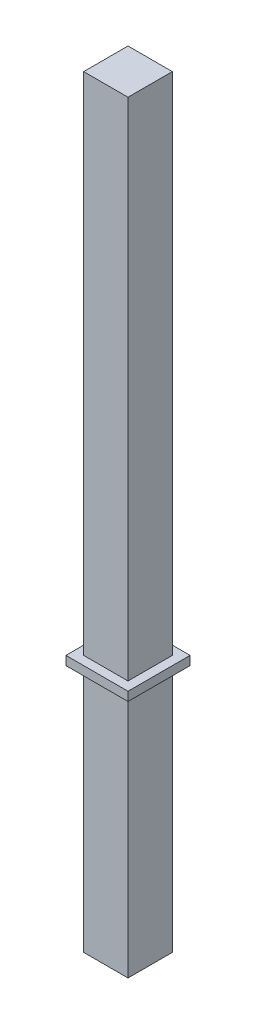
ISO-10303-21;
HEADER;
FILE_DESCRIPTION(('STEP AP214'),'2;1');
FILE_NAME('part.step','',(''),(''),'','','');
FILE_SCHEMA(('AUTOMOTIVE_DESIGN { 1 0 10303 214 1 1 1 1 }'));
ENDSEC;
DATA;
#1=APPLICATION_CONTEXT('core data for automotive mechanical design processes');
#2=APPLICATION_PROTOCOL_DEFINITION('international standard','automotive_design',2000,#1);
#3=PRODUCT_CONTEXT('',#1,'mechanical');
#4=PRODUCT('Part','Part','',(#3));
#5=PRODUCT_RELATED_PRODUCT_CATEGORY('part','',(#4));
#6=PRODUCT_DEFINITION_FORMATION('','',#4);
#7=PRODUCT_DEFINITION_CONTEXT('part definition',#1,'design');
#8=PRODUCT_DEFINITION('design','',#6,#7);
#9=PRODUCT_DEFINITION_SHAPE('','',#8);
#10=(LENGTH_UNIT() NAMED_UNIT(*) SI_UNIT(.MILLI.,.METRE.));
#11=(NAMED_UNIT(*) PLANE_ANGLE_UNIT() SI_UNIT($,.RADIAN.));
#12=(NAMED_UNIT(*) SI_UNIT($,.STERADIAN.) SOLID_ANGLE_UNIT());
#13=UNCERTAINTY_MEASURE_WITH_UNIT(LENGTH_MEASURE(1.E-05),#10,'distance_accuracy_value','');
#14=(GEOMETRIC_REPRESENTATION_CONTEXT(3) GLOBAL_UNCERTAINTY_ASSIGNED_CONTEXT((#13)) GLOBAL_UNIT_ASSIGNED_CONTEXT((#10,
#11,#12)) REPRESENTATION_CONTEXT('',''));
#15=CARTESIAN_POINT('',(0.,0.,0.));
#16=DIRECTION('',(0.,0.,1.));
#17=DIRECTION('',(1.,0.,0.));
#18=AXIS2_PLACEMENT_3D('',#15,#16,#17);
#19=CARTESIAN_POINT('',(0.3175,0.,0.3175));
#20=DIRECTION('',(-1.,0.,0.));
#21=DIRECTION('',(0.,0.,1.));
#22=AXIS2_PLACEMENT_3D('',#19,#20,#21);
#23=PLANE('',#22);
#24=DIRECTION('',(0.,0.,-1.));
#25=VECTOR('',#24,1.);
#26=CARTESIAN_POINT('',(0.3175,3.556,0.3175));
#27=LINE('',#26,#25);
#28=CARTESIAN_POINT('',(0.3175,3.556,0.3175));
#29=VERTEX_POINT('',#28);
#30=CARTESIAN_POINT('',(0.3175,3.556,-0.3175));
#31=VERTEX_POINT('',#30);
#32=EDGE_CURVE('E11',#29,#31,#27,.T.);
#33=ORIENTED_EDGE('',*,*,#32,.F.);
#34=DIRECTION('',(0.,1.,0.));
#35=VECTOR('',#34,1.);
#36=CARTESIAN_POINT('',(0.3175,0.,0.3175));
#37=LINE('',#36,#35);
#38=CARTESIAN_POINT('',(0.3175,0.,0.3175));
#39=VERTEX_POINT('',#38);
#40=EDGE_CURVE('E25',#39,#29,#37,.T.);
#41=ORIENTED_EDGE('',*,*,#40,.F.);
#42=DIRECTION('',(0.,0.,-1.));
#43=VECTOR('',#42,1.);
#44=CARTESIAN_POINT('',(0.3175,0.,0.3175));
#45=LINE('',#44,#43);
#46=CARTESIAN_POINT('',(0.3175,0.,-0.3175));
#47=VERTEX_POINT('',#46);
#48=EDGE_CURVE('E264',#39,#47,#45,.T.);
#49=ORIENTED_EDGE('',*,*,#48,.T.);
#50=DIRECTION('',(0.,1.,0.));
#51=VECTOR('',#50,1.);
#52=CARTESIAN_POINT('',(0.3175,0.,-0.3175));
#53=LINE('',#52,#51);
#54=EDGE_CURVE('E260',#47,#31,#53,.T.);
#55=ORIENTED_EDGE('',*,*,#54,.T.);
#56=EDGE_LOOP('',(#33,#41,#49,#55));
#57=FACE_BOUND('',#56,.T.);
#58=ADVANCED_FACE('F17',(#57),#23,.F.);
#59=CARTESIAN_POINT('',(0.,0.,-0.3175));
#60=DIRECTION('',(0.,0.,1.));
#61=DIRECTION('',(1.,0.,0.));
#62=AXIS2_PLACEMENT_3D('',#59,#60,#61);
#63=PLANE('',#62);
#64=DIRECTION('',(-1.,0.,0.));
#65=VECTOR('',#64,1.);
#66=CARTESIAN_POINT('',(0.,3.556,-0.3175));
#67=LINE('',#66,#65);
#68=CARTESIAN_POINT('',(-0.3175,3.556,-0.3175));
#69=VERTEX_POINT('',#68);
#70=EDGE_CURVE('E255',#31,#69,#67,.T.);
#71=ORIENTED_EDGE('',*,*,#70,.F.);
#72=ORIENTED_EDGE('',*,*,#54,.F.);
#73=DIRECTION('',(1.,0.,0.));
#74=VECTOR('',#73,1.);
#75=CARTESIAN_POINT('',(-0.3175,0.,-0.3175));
#76=LINE('',#75,#74);
#77=CARTESIAN_POINT('',(-0.3175,0.,-0.3175));
#78=VERTEX_POINT('',#77);
#79=EDGE_CURVE('E250',#78,#47,#76,.T.);
#80=ORIENTED_EDGE('',*,*,#79,.F.);
#81=DIRECTION('',(0.,-1.,0.));
#82=VECTOR('',#81,1.);
#83=CARTESIAN_POINT('',(-0.3175,10.922,-0.3175));
#84=LINE('',#83,#82);
#85=EDGE_CURVE('E245',#69,#78,#84,.T.);
#86=ORIENTED_EDGE('',*,*,#85,.F.);
#87=EDGE_LOOP('',(#71,#72,#80,#86));
#88=FACE_BOUND('',#87,.T.);
#89=ADVANCED_FACE('F281',(#88),#63,.F.);
#90=CARTESIAN_POINT('',(-0.3175,10.922,0.3175));
#91=DIRECTION('',(1.,0.,0.));
#92=DIRECTION('',(0.,0.,-1.));
#93=AXIS2_PLACEMENT_3D('',#90,#91,#92);
#94=PLANE('',#93);
#95=ORIENTED_EDGE('',*,*,#85,.T.);
#96=DIRECTION('',(0.,0.,-1.));
#97=VECTOR('',#96,1.);
#98=CARTESIAN_POINT('',(-0.3175,0.,0.3175));
#99=LINE('',#98,#97);
#100=CARTESIAN_POINT('',(-0.3175,0.,0.3175));
#101=VERTEX_POINT('',#100);
#102=EDGE_CURVE('E240',#101,#78,#99,.T.);
#103=ORIENTED_EDGE('',*,*,#102,.F.);
#104=DIRECTION('',(0.,-1.,0.));
#105=VECTOR('',#104,1.);
#106=CARTESIAN_POINT('',(-0.3175,10.922,0.3175));
#107=LINE('',#106,#105);
#108=CARTESIAN_POINT('',(-0.3175,3.556,0.3175));
#109=VERTEX_POINT('',#108);
#110=EDGE_CURVE('E235',#109,#101,#107,.T.);
#111=ORIENTED_EDGE('',*,*,#110,.F.);
#112=DIRECTION('',(0.,0.,1.));
#113=VECTOR('',#112,1.);
#114=CARTESIAN_POINT('',(-0.3175,3.556,0.3175));
#115=LINE('',#114,#113);
#116=EDGE_CURVE('E230',#69,#109,#115,.T.);
#117=ORIENTED_EDGE('',*,*,#116,.F.);
#118=EDGE_LOOP('',(#95,#103,#111,#117));
#119=FACE_BOUND('',#118,.T.);
#120=ADVANCED_FACE('F287',(#119),#94,.F.);
#121=CARTESIAN_POINT('',(0.4445,3.556,0.4445));
#122=DIRECTION('',(0.,1.,0.));
#123=DIRECTION('',(0.,0.,1.));
#124=AXIS2_PLACEMENT_3D('',#121,#122,#123);
#125=PLANE('',#124);
#126=DIRECTION('',(-1.,0.,0.));
#127=VECTOR('',#126,1.);
#128=CARTESIAN_POINT('',(0.,3.556,0.3175));
#129=LINE('',#128,#127);
#130=EDGE_CURVE('E225',#29,#109,#129,.T.);
#131=ORIENTED_EDGE('',*,*,#130,.F.);
#132=ORIENTED_EDGE('',*,*,#32,.T.);
#133=ORIENTED_EDGE('',*,*,#70,.T.);
#134=ORIENTED_EDGE('',*,*,#116,.T.);
#135=EDGE_LOOP('',(#131,#132,#133,#134));
#136=FACE_BOUND('',#135,.T.);
#137=DIRECTION('',(0.,0.,-1.));
#138=VECTOR('',#137,1.);
#139=CARTESIAN_POINT('',(-0.4445,3.556,0.4445));
#140=LINE('',#139,#138);
#141=CARTESIAN_POINT('',(-0.4445,3.556,0.4445));
#142=VERTEX_POINT('',#141);
#143=CARTESIAN_POINT('',(-0.4445,3.556,-0.4445));
#144=VERTEX_POINT('',#143);
#145=EDGE_CURVE('E221',#142,#144,#140,.T.);
#146=ORIENTED_EDGE('',*,*,#145,.T.);
#147=DIRECTION('',(-1.,0.,0.));
#148=VECTOR('',#147,1.);
#149=CARTESIAN_POINT('',(0.4445,3.556,-0.4445));
#150=LINE('',#149,#148);
#151=CARTESIAN_POINT('',(0.4445,3.556,-0.4445));
#152=VERTEX_POINT('',#151);
#153=EDGE_CURVE('E216',#152,#144,#150,.T.);
#154=ORIENTED_EDGE('',*,*,#153,.F.);
#155=DIRECTION('',(0.,0.,-1.));
#156=VECTOR('',#155,1.);
#157=CARTESIAN_POINT('',(0.4445,3.556,0.4445));
#158=LINE('',#157,#156);
#159=CARTESIAN_POINT('',(0.4445,3.556,0.4445));
#160=VERTEX_POINT('',#159);
#161=EDGE_CURVE('E211',#160,#152,#158,.T.);
#162=ORIENTED_EDGE('',*,*,#161,.F.);
#163=DIRECTION('',(-1.,0.,0.));
#164=VECTOR('',#163,1.);
#165=CARTESIAN_POINT('',(0.4445,3.556,0.4445));
#166=LINE('',#165,#164);
#167=EDGE_CURVE('E207',#160,#142,#166,.T.);
#168=ORIENTED_EDGE('',*,*,#167,.T.);
#169=EDGE_LOOP('',(#146,#154,#162,#168));
#170=FACE_BOUND('',#169,.T.);
#171=ADVANCED_FACE('F284',(#136,#170),#125,.F.);
#172=CARTESIAN_POINT('',(0.4445,3.683,0.4445));
#173=DIRECTION('',(0.,0.,-1.));
#174=DIRECTION('',(-1.,0.,0.));
#175=AXIS2_PLACEMENT_3D('',#172,#173,#174);
#176=PLANE('',#175);
#177=DIRECTION('',(0.,-1.,0.));
#178=VECTOR('',#177,1.);
#179=CARTESIAN_POINT('',(-0.4445,3.683,0.4445));
#180=LINE('',#179,#178);
#181=CARTESIAN_POINT('',(-0.4445,3.683,0.4445));
#182=VERTEX_POINT('',#181);
#183=EDGE_CURVE('E202',#182,#142,#180,.T.);
#184=ORIENTED_EDGE('',*,*,#183,.T.);
#185=ORIENTED_EDGE('',*,*,#167,.F.);
#186=DIRECTION('',(0.,-1.,0.));
#187=VECTOR('',#186,1.);
#188=CARTESIAN_POINT('',(0.4445,3.683,0.4445));
#189=LINE('',#188,#187);
#190=CARTESIAN_POINT('',(0.4445,3.683,0.4445));
#191=VERTEX_POINT('',#190);
#192=EDGE_CURVE('E197',#191,#160,#189,.T.);
#193=ORIENTED_EDGE('',*,*,#192,.F.);
#194=DIRECTION('',(-1.,0.,0.));
#195=VECTOR('',#194,1.);
#196=CARTESIAN_POINT('',(0.4445,3.683,0.4445));
#197=LINE('',#196,#195);
#198=EDGE_CURVE('E193',#191,#182,#197,.T.);
#199=ORIENTED_EDGE('',*,*,#198,.T.);
#200=EDGE_LOOP('',(#184,#185,#193,#199));
#201=FACE_BOUND('',#200,.T.);
#202=ADVANCED_FACE('F295',(#201),#176,.F.);
#203=CARTESIAN_POINT('',(0.4445,3.683,-0.4445));
#204=DIRECTION('',(0.,-1.,0.));
#205=DIRECTION('',(0.,0.,-1.));
#206=AXIS2_PLACEMENT_3D('',#203,#204,#205);
#207=PLANE('',#206);
#208=DIRECTION('',(1.,0.,0.));
#209=VECTOR('',#208,1.);
#210=CARTESIAN_POINT('',(0.,3.683,0.3175));
#211=LINE('',#210,#209);
#212=CARTESIAN_POINT('',(-0.3175,3.683,0.3175));
#213=VERTEX_POINT('',#212);
#214=CARTESIAN_POINT('',(0.3175,3.683,0.3175));
#215=VERTEX_POINT('',#214);
#216=EDGE_CURVE('E189',#213,#215,#211,.T.);
#217=ORIENTED_EDGE('',*,*,#216,.F.);
#218=DIRECTION('',(0.,0.,-1.));
#219=VECTOR('',#218,1.);
#220=CARTESIAN_POINT('',(-0.3175,3.683,0.3175));
#221=LINE('',#220,#219);
#222=CARTESIAN_POINT('',(-0.3175,3.683,-0.3175));
#223=VERTEX_POINT('',#222);
#224=EDGE_CURVE('E109',#213,#223,#221,.T.);
#225=ORIENTED_EDGE('',*,*,#224,.T.);
#226=DIRECTION('',(1.,0.,0.));
#227=VECTOR('',#226,1.);
#228=CARTESIAN_POINT('',(0.,3.683,-0.3175));
#229=LINE('',#228,#227);
#230=CARTESIAN_POINT('',(0.3175,3.683,-0.3175));
#231=VERTEX_POINT('',#230);
#232=EDGE_CURVE('E182',#223,#231,#229,.T.);
#233=ORIENTED_EDGE('',*,*,#232,.T.);
#234=DIRECTION('',(0.,0.,1.));
#235=VECTOR('',#234,1.);
#236=CARTESIAN_POINT('',(0.3175,3.683,0.3175));
#237=LINE('',#236,#235);
#238=EDGE_CURVE('E178',#231,#215,#237,.T.);
#239=ORIENTED_EDGE('',*,*,#238,.T.);
#240=EDGE_LOOP('',(#217,#225,#233,#239));
#241=FACE_BOUND('',#240,.T.);
#242=DIRECTION('',(0.,0.,1.));
#243=VECTOR('',#242,1.);
#244=CARTESIAN_POINT('',(-0.4445,3.683,-0.4445));
#245=LINE('',#244,#243);
#246=CARTESIAN_POINT('',(-0.4445,3.683,-0.4445));
#247=VERTEX_POINT('',#246);
#248=EDGE_CURVE('E173',#247,#182,#245,.T.);
#249=ORIENTED_EDGE('',*,*,#248,.T.);
#250=ORIENTED_EDGE('',*,*,#198,.F.);
#251=DIRECTION('',(0.,0.,1.));
#252=VECTOR('',#251,1.);
#253=CARTESIAN_POINT('',(0.4445,3.683,-0.4445));
#254=LINE('',#253,#252);
#255=CARTESIAN_POINT('',(0.4445,3.683,-0.4445));
#256=VERTEX_POINT('',#255);
#257=EDGE_CURVE('E168',#256,#191,#254,.T.);
#258=ORIENTED_EDGE('',*,*,#257,.F.);
#259=DIRECTION('',(-1.,0.,0.));
#260=VECTOR('',#259,1.);
#261=CARTESIAN_POINT('',(0.4445,3.683,-0.4445));
#262=LINE('',#261,#260);
#263=EDGE_CURVE('E164',#256,#247,#262,.T.);
#264=ORIENTED_EDGE('',*,*,#263,.T.);
#265=EDGE_LOOP('',(#249,#250,#258,#264));
#266=FACE_BOUND('',#265,.T.);
#267=ADVANCED_FACE('F327',(#241,#266),#207,.F.);
#268=CARTESIAN_POINT('',(0.4445,3.556,-0.4445));
#269=DIRECTION('',(0.,0.,1.));
#270=DIRECTION('',(1.,0.,0.));
#271=AXIS2_PLACEMENT_3D('',#268,#269,#270);
#272=PLANE('',#271);
#273=DIRECTION('',(0.,1.,0.));
#274=VECTOR('',#273,1.);
#275=CARTESIAN_POINT('',(-0.4445,3.556,-0.4445));
#276=LINE('',#275,#274);
#277=EDGE_CURVE('E159',#144,#247,#276,.T.);
#278=ORIENTED_EDGE('',*,*,#277,.T.);
#279=ORIENTED_EDGE('',*,*,#263,.F.);
#280=DIRECTION('',(0.,1.,0.));
#281=VECTOR('',#280,1.);
#282=CARTESIAN_POINT('',(0.4445,3.556,-0.4445));
#283=LINE('',#282,#281);
#284=EDGE_CURVE('E154',#152,#256,#283,.T.);
#285=ORIENTED_EDGE('',*,*,#284,.F.);
#286=ORIENTED_EDGE('',*,*,#153,.T.);
#287=EDGE_LOOP('',(#278,#279,#285,#286));
#288=FACE_BOUND('',#287,.T.);
#289=ADVANCED_FACE('F337',(#288),#272,.F.);
#290=CARTESIAN_POINT('',(0.4445,0.,0.));
#291=DIRECTION('',(1.,0.,0.));
#292=DIRECTION('',(0.,0.,-1.));
#293=AXIS2_PLACEMENT_3D('',#290,#291,#292);
#294=PLANE('',#293);
#295=ORIENTED_EDGE('',*,*,#257,.T.);
#296=ORIENTED_EDGE('',*,*,#192,.T.);
#297=ORIENTED_EDGE('',*,*,#161,.T.);
#298=ORIENTED_EDGE('',*,*,#284,.T.);
#299=EDGE_LOOP('',(#295,#296,#297,#298));
#300=FACE_BOUND('',#299,.T.);
#301=ADVANCED_FACE('F347',(#300),#294,.T.);
#302=CARTESIAN_POINT('',(-0.4445,0.,0.));
#303=DIRECTION('',(1.,0.,0.));
#304=DIRECTION('',(0.,0.,-1.));
#305=AXIS2_PLACEMENT_3D('',#302,#303,#304);
#306=PLANE('',#305);
#307=ORIENTED_EDGE('',*,*,#248,.F.);
#308=ORIENTED_EDGE('',*,*,#277,.F.);
#309=ORIENTED_EDGE('',*,*,#145,.F.);
#310=ORIENTED_EDGE('',*,*,#183,.F.);
#311=EDGE_LOOP('',(#307,#308,#309,#310));
#312=FACE_BOUND('',#311,.T.);
#313=ADVANCED_FACE('F357',(#312),#306,.F.);
#314=CARTESIAN_POINT('',(0.3175,0.,0.3175));
#315=DIRECTION('',(-1.,0.,0.));
#316=DIRECTION('',(0.,0.,1.));
#317=AXIS2_PLACEMENT_3D('',#314,#315,#316);
#318=PLANE('',#317);
#319=DIRECTION('',(0.,0.,-1.));
#320=VECTOR('',#319,1.);
#321=CARTESIAN_POINT('',(0.3175,10.922,0.3175));
#322=LINE('',#321,#320);
#323=CARTESIAN_POINT('',(0.3175,10.922,0.3175));
#324=VERTEX_POINT('',#323);
#325=CARTESIAN_POINT('',(0.3175,10.922,-0.3175));
#326=VERTEX_POINT('',#325);
#327=EDGE_CURVE('E150',#324,#326,#322,.T.);
#328=ORIENTED_EDGE('',*,*,#327,.F.);
#329=DIRECTION('',(0.,1.,0.));
#330=VECTOR('',#329,1.);
#331=CARTESIAN_POINT('',(0.3175,0.,0.3175));
#332=LINE('',#331,#330);
#333=EDGE_CURVE('E126',#215,#324,#332,.T.);
#334=ORIENTED_EDGE('',*,*,#333,.F.);
#335=ORIENTED_EDGE('',*,*,#238,.F.);
#336=DIRECTION('',(0.,1.,0.));
#337=VECTOR('',#336,1.);
#338=CARTESIAN_POINT('',(0.3175,0.,-0.3175));
#339=LINE('',#338,#337);
#340=EDGE_CURVE('E143',#231,#326,#339,.T.);
#341=ORIENTED_EDGE('',*,*,#340,.T.);
#342=EDGE_LOOP('',(#328,#334,#335,#341));
#343=FACE_BOUND('',#342,.T.);
#344=ADVANCED_FACE('F367',(#343),#318,.F.);
#345=CARTESIAN_POINT('',(0.,0.,-0.3175));
#346=DIRECTION('',(0.,0.,1.));
#347=DIRECTION('',(1.,0.,0.));
#348=AXIS2_PLACEMENT_3D('',#345,#346,#347);
#349=PLANE('',#348);
#350=DIRECTION('',(-1.,0.,0.));
#351=VECTOR('',#350,1.);
#352=CARTESIAN_POINT('',(0.3175,10.922,-0.3175));
#353=LINE('',#352,#351);
#354=CARTESIAN_POINT('',(-0.3175,10.922,-0.3175));
#355=VERTEX_POINT('',#354);
#356=EDGE_CURVE('E122',#326,#355,#353,.T.);
#357=ORIENTED_EDGE('',*,*,#356,.F.);
#358=ORIENTED_EDGE('',*,*,#340,.F.);
#359=ORIENTED_EDGE('',*,*,#232,.F.);
#360=DIRECTION('',(0.,-1.,0.));
#361=VECTOR('',#360,1.);
#362=CARTESIAN_POINT('',(-0.3175,10.922,-0.3175));
#363=LINE('',#362,#361);
#364=EDGE_CURVE('E113',#355,#223,#363,.T.);
#365=ORIENTED_EDGE('',*,*,#364,.F.);
#366=EDGE_LOOP('',(#357,#358,#359,#365));
#367=FACE_BOUND('',#366,.T.);
#368=ADVANCED_FACE('F377',(#367),#349,.F.);
#369=CARTESIAN_POINT('',(-0.3175,10.922,0.3175));
#370=DIRECTION('',(1.,0.,0.));
#371=DIRECTION('',(0.,0.,-1.));
#372=AXIS2_PLACEMENT_3D('',#369,#370,#371);
#373=PLANE('',#372);
#374=ORIENTED_EDGE('',*,*,#364,.T.);
#375=ORIENTED_EDGE('',*,*,#224,.F.);
#376=DIRECTION('',(0.,-1.,0.));
#377=VECTOR('',#376,1.);
#378=CARTESIAN_POINT('',(-0.3175,10.922,0.3175));
#379=LINE('',#378,#377);
#380=CARTESIAN_POINT('',(-0.3175,10.922,0.3175));
#381=VERTEX_POINT('',#380);
#382=EDGE_CURVE('E103',#381,#213,#379,.T.);
#383=ORIENTED_EDGE('',*,*,#382,.F.);
#384=DIRECTION('',(0.,0.,-1.));
#385=VECTOR('',#384,1.);
#386=CARTESIAN_POINT('',(-0.3175,10.922,0.3175));
#387=LINE('',#386,#385);
#388=EDGE_CURVE('E107',#381,#355,#387,.T.);
#389=ORIENTED_EDGE('',*,*,#388,.T.);
#390=EDGE_LOOP('',(#374,#375,#383,#389));
#391=FACE_BOUND('',#390,.T.);
#392=ADVANCED_FACE('F106',(#391),#373,.F.);
#393=CARTESIAN_POINT('',(0.3175,10.922,0.3175));
#394=DIRECTION('',(0.,-1.,0.));
#395=DIRECTION('',(0.,0.,-1.));
#396=AXIS2_PLACEMENT_3D('',#393,#394,#395);
#397=PLANE('',#396);
#398=ORIENTED_EDGE('',*,*,#356,.T.);
#399=ORIENTED_EDGE('',*,*,#388,.F.);
#400=DIRECTION('',(-1.,0.,0.));
#401=VECTOR('',#400,1.);
#402=CARTESIAN_POINT('',(0.3175,10.922,0.3175));
#403=LINE('',#402,#401);
#404=EDGE_CURVE('E119',#324,#381,#403,.T.);
#405=ORIENTED_EDGE('',*,*,#404,.F.);
#406=ORIENTED_EDGE('',*,*,#327,.T.);
#407=EDGE_LOOP('',(#398,#399,#405,#406));
#408=FACE_BOUND('',#407,.T.);
#409=ADVANCED_FACE('F117',(#408),#397,.F.);
#410=CARTESIAN_POINT('',(0.,0.,0.3175));
#411=DIRECTION('',(0.,0.,1.));
#412=DIRECTION('',(1.,0.,0.));
#413=AXIS2_PLACEMENT_3D('',#410,#411,#412);
#414=PLANE('',#413);
#415=ORIENTED_EDGE('',*,*,#382,.T.);
#416=ORIENTED_EDGE('',*,*,#216,.T.);
#417=ORIENTED_EDGE('',*,*,#333,.T.);
#418=ORIENTED_EDGE('',*,*,#404,.T.);
#419=EDGE_LOOP('',(#415,#416,#417,#418));
#420=FACE_BOUND('',#419,.T.);
#421=ADVANCED_FACE('F124',(#420),#414,.T.);
#422=CARTESIAN_POINT('',(0.,0.,0.3175));
#423=DIRECTION('',(0.,0.,1.));
#424=DIRECTION('',(1.,0.,0.));
#425=AXIS2_PLACEMENT_3D('',#422,#423,#424);
#426=PLANE('',#425);
#427=ORIENTED_EDGE('',*,*,#110,.T.);
#428=DIRECTION('',(1.,0.,0.));
#429=VECTOR('',#428,1.);
#430=CARTESIAN_POINT('',(-0.3175,0.,0.3175));
#431=LINE('',#430,#429);
#432=EDGE_CURVE('E127',#101,#39,#431,.T.);
#433=ORIENTED_EDGE('',*,*,#432,.T.);
#434=ORIENTED_EDGE('',*,*,#40,.T.);
#435=ORIENTED_EDGE('',*,*,#130,.T.);
#436=EDGE_LOOP('',(#427,#433,#434,#435));
#437=FACE_BOUND('',#436,.T.);
#438=ADVANCED_FACE('F273',(#437),#426,.T.);
#439=CARTESIAN_POINT('',(-0.3175,0.,0.3175));
#440=DIRECTION('',(0.,1.,0.));
#441=DIRECTION('',(0.,0.,1.));
#442=AXIS2_PLACEMENT_3D('',#439,#440,#441);
#443=PLANE('',#442);
#444=ORIENTED_EDGE('',*,*,#79,.T.);
#445=ORIENTED_EDGE('',*,*,#48,.F.);
#446=ORIENTED_EDGE('',*,*,#432,.F.);
#447=ORIENTED_EDGE('',*,*,#102,.T.);
#448=EDGE_LOOP('',(#444,#445,#446,#447));
#449=FACE_BOUND('',#448,.T.);
#450=ADVANCED_FACE('F277',(#449),#443,.F.);
#451=CLOSED_SHELL('',(#58,#89,#120,#171,#202,#267,#289,#301,#313,#344,#368,#392,#409,#421,#438,#450));
#452=MANIFOLD_SOLID_BREP('B1',#451);
#453=ADVANCED_BREP_SHAPE_REPRESENTATION('',(#18,#452),#14);
#454=SHAPE_DEFINITION_REPRESENTATION(#9,#453);
ENDSEC;
END-ISO-10303-21;
